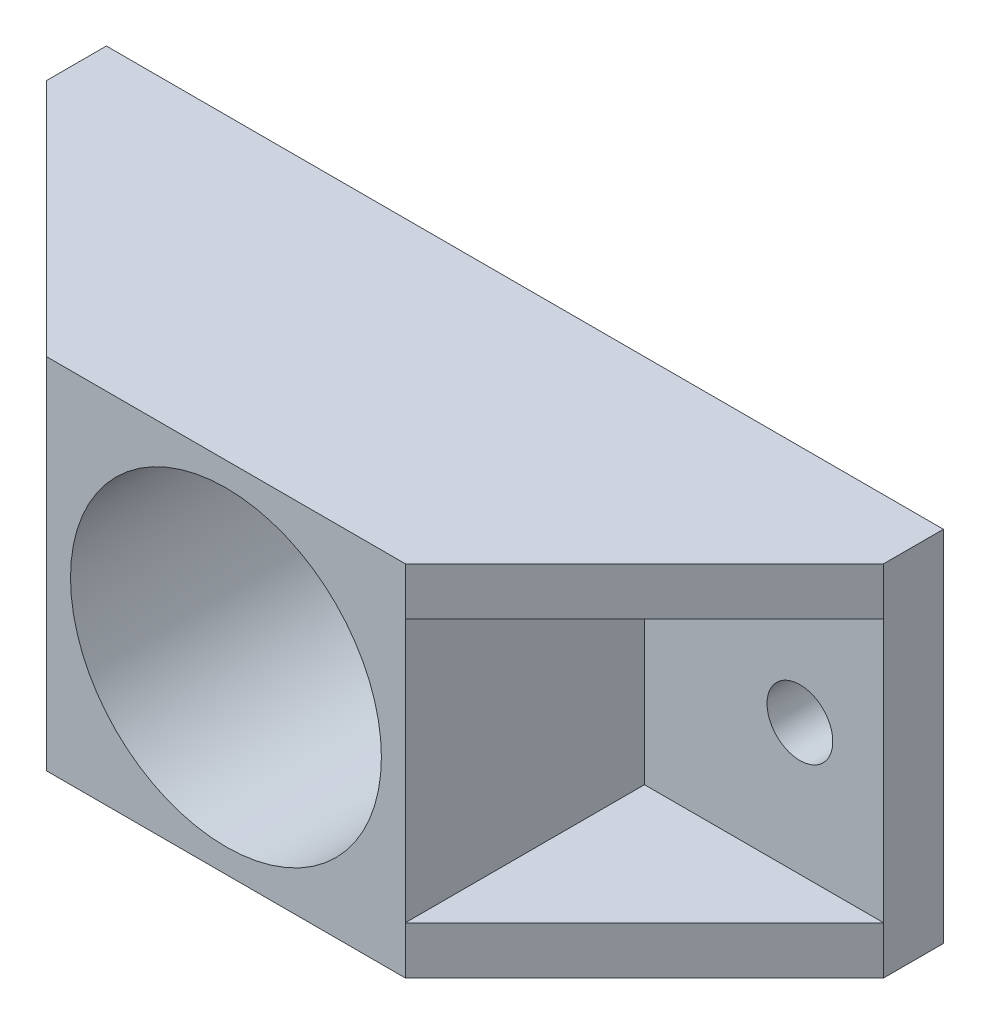
ISO-10303-21;
HEADER;
FILE_DESCRIPTION(('STEP AP214'),'2;1');
FILE_NAME('part.step','',(''),(''),'','','');
FILE_SCHEMA(('AUTOMOTIVE_DESIGN { 1 0 10303 214 1 1 1 1 }'));
ENDSEC;
DATA;
#1=APPLICATION_CONTEXT('core data for automotive mechanical design processes');
#2=APPLICATION_PROTOCOL_DEFINITION('international standard','automotive_design',2000,#1);
#3=PRODUCT_CONTEXT('',#1,'mechanical');
#4=PRODUCT('Part','Part','',(#3));
#5=PRODUCT_RELATED_PRODUCT_CATEGORY('part','',(#4));
#6=PRODUCT_DEFINITION_FORMATION('','',#4);
#7=PRODUCT_DEFINITION_CONTEXT('part definition',#1,'design');
#8=PRODUCT_DEFINITION('design','',#6,#7);
#9=PRODUCT_DEFINITION_SHAPE('','',#8);
#10=(LENGTH_UNIT() NAMED_UNIT(*) SI_UNIT(.MILLI.,.METRE.));
#11=(NAMED_UNIT(*) PLANE_ANGLE_UNIT() SI_UNIT($,.RADIAN.));
#12=(NAMED_UNIT(*) SI_UNIT($,.STERADIAN.) SOLID_ANGLE_UNIT());
#13=UNCERTAINTY_MEASURE_WITH_UNIT(LENGTH_MEASURE(1.E-05),#10,'distance_accuracy_value','');
#14=(GEOMETRIC_REPRESENTATION_CONTEXT(3) GLOBAL_UNCERTAINTY_ASSIGNED_CONTEXT((#13)) GLOBAL_UNIT_ASSIGNED_CONTEXT((#10,
#11,#12)) REPRESENTATION_CONTEXT('',''));
#15=CARTESIAN_POINT('',(0.,0.,0.));
#16=DIRECTION('',(0.,0.,1.));
#17=DIRECTION('',(1.,0.,0.));
#18=AXIS2_PLACEMENT_3D('',#15,#16,#17);
#19=CARTESIAN_POINT('',(0.,0.,5.));
#20=DIRECTION('',(0.,0.,1.));
#21=DIRECTION('',(1.,0.,0.));
#22=AXIS2_PLACEMENT_3D('',#19,#20,#21);
#23=PLANE('',#22);
#24=CARTESIAN_POINT('',(28.,0.,5.));
#25=DIRECTION('',(0.,0.,1.));
#26=DIRECTION('',(-1.,0.,0.));
#27=AXIS2_PLACEMENT_3D('',#24,#25,#26);
#28=CIRCLE('',#27,2.75);
#29=CARTESIAN_POINT('',(25.25,0.,5.));
#30=VERTEX_POINT('',#29);
#31=EDGE_CURVE('E201',#30,#30,#28,.T.);
#32=ORIENTED_EDGE('',*,*,#31,.F.);
#33=EDGE_LOOP('',(#32));
#34=FACE_BOUND('',#33,.T.);
#35=DIRECTION('',(0.,1.,0.));
#36=VECTOR('',#35,1.);
#37=CARTESIAN_POINT('',(35.,15.,5.));
#38=LINE('',#37,#36);
#39=CARTESIAN_POINT('',(35.,-11.,5.));
#40=VERTEX_POINT('',#39);
#41=CARTESIAN_POINT('',(35.,11.,5.));
#42=VERTEX_POINT('',#41);
#43=EDGE_CURVE('E165',#40,#42,#38,.T.);
#44=ORIENTED_EDGE('',*,*,#43,.T.);
#45=DIRECTION('',(1.,0.,0.));
#46=VECTOR('',#45,1.);
#47=CARTESIAN_POINT('',(15.,11.,5.));
#48=LINE('',#47,#46);
#49=CARTESIAN_POINT('',(15.,11.,5.));
#50=VERTEX_POINT('',#49);
#51=EDGE_CURVE('E139',#50,#42,#48,.T.);
#52=ORIENTED_EDGE('',*,*,#51,.F.);
#53=DIRECTION('',(0.,1.,0.));
#54=VECTOR('',#53,1.);
#55=CARTESIAN_POINT('',(15.,-15.,5.));
#56=LINE('',#55,#54);
#57=CARTESIAN_POINT('',(15.,-11.,5.));
#58=VERTEX_POINT('',#57);
#59=EDGE_CURVE('E194',#58,#50,#56,.T.);
#60=ORIENTED_EDGE('',*,*,#59,.F.);
#61=DIRECTION('',(1.,0.,0.));
#62=VECTOR('',#61,1.);
#63=CARTESIAN_POINT('',(15.,-11.,5.));
#64=LINE('',#63,#62);
#65=EDGE_CURVE('E170',#58,#40,#64,.T.);
#66=ORIENTED_EDGE('',*,*,#65,.T.);
#67=EDGE_LOOP('',(#44,#52,#60,#66));
#68=FACE_BOUND('',#67,.T.);
#69=ADVANCED_FACE('F48',(#34,#68),#23,.T.);
#70=CARTESIAN_POINT('',(15.,-15.,25.));
#71=DIRECTION('',(-1.,0.,0.));
#72=DIRECTION('',(0.,0.,1.));
#73=AXIS2_PLACEMENT_3D('',#70,#71,#72);
#74=PLANE('',#73);
#75=DIRECTION('',(0.,0.,-1.));
#76=VECTOR('',#75,1.);
#77=CARTESIAN_POINT('',(15.,11.,25.));
#78=LINE('',#77,#76);
#79=CARTESIAN_POINT('',(15.,11.,25.));
#80=VERTEX_POINT('',#79);
#81=EDGE_CURVE('E145',#80,#50,#78,.T.);
#82=ORIENTED_EDGE('',*,*,#81,.F.);
#83=DIRECTION('',(0.,1.,0.));
#84=VECTOR('',#83,1.);
#85=CARTESIAN_POINT('',(15.,-15.,25.));
#86=LINE('',#85,#84);
#87=CARTESIAN_POINT('',(15.,-11.,25.));
#88=VERTEX_POINT('',#87);
#89=EDGE_CURVE('E287',#88,#80,#86,.T.);
#90=ORIENTED_EDGE('',*,*,#89,.F.);
#91=DIRECTION('',(0.,0.,-1.));
#92=VECTOR('',#91,1.);
#93=CARTESIAN_POINT('',(15.,-11.,25.));
#94=LINE('',#93,#92);
#95=EDGE_CURVE('E322',#88,#58,#94,.T.);
#96=ORIENTED_EDGE('',*,*,#95,.T.);
#97=ORIENTED_EDGE('',*,*,#59,.T.);
#98=EDGE_LOOP('',(#82,#90,#96,#97));
#99=FACE_BOUND('',#98,.T.);
#100=ADVANCED_FACE('F233',(#99),#74,.F.);
#101=DIRECTION('',(1.,0.,0.));
#102=VECTOR('',#101,1.);
#103=CARTESIAN_POINT('',(-35.,11.,5.));
#104=LINE('',#103,#102);
#105=CARTESIAN_POINT('',(-35.,11.,5.));
#106=VERTEX_POINT('',#105);
#107=CARTESIAN_POINT('',(-15.,11.,5.));
#108=VERTEX_POINT('',#107);
#109=EDGE_CURVE('E252',#106,#108,#104,.T.);
#110=ORIENTED_EDGE('',*,*,#109,.F.);
#111=DIRECTION('',(0.,-1.,0.));
#112=VECTOR('',#111,1.);
#113=CARTESIAN_POINT('',(-35.,15.,5.));
#114=LINE('',#113,#112);
#115=CARTESIAN_POINT('',(-35.,-11.,5.));
#116=VERTEX_POINT('',#115);
#117=EDGE_CURVE('E176',#106,#116,#114,.T.);
#118=ORIENTED_EDGE('',*,*,#117,.T.);
#119=DIRECTION('',(1.,0.,0.));
#120=VECTOR('',#119,1.);
#121=CARTESIAN_POINT('',(-35.,-11.,5.));
#122=LINE('',#121,#120);
#123=CARTESIAN_POINT('',(-15.,-11.,5.));
#124=VERTEX_POINT('',#123);
#125=EDGE_CURVE('E273',#116,#124,#122,.T.);
#126=ORIENTED_EDGE('',*,*,#125,.T.);
#127=DIRECTION('',(0.,-1.,0.));
#128=VECTOR('',#127,1.);
#129=CARTESIAN_POINT('',(-15.,-15.,5.));
#130=LINE('',#129,#128);
#131=EDGE_CURVE('E52',#108,#124,#130,.T.);
#132=ORIENTED_EDGE('',*,*,#131,.F.);
#133=EDGE_LOOP('',(#110,#118,#126,#132));
#134=FACE_BOUND('',#133,.T.);
#135=CARTESIAN_POINT('',(-28.,0.,5.));
#136=DIRECTION('',(0.,0.,1.));
#137=DIRECTION('',(1.,0.,0.));
#138=AXIS2_PLACEMENT_3D('',#135,#136,#137);
#139=CIRCLE('',#138,2.75);
#140=CARTESIAN_POINT('',(-25.25,0.,5.));
#141=VERTEX_POINT('',#140);
#142=EDGE_CURVE('E184',#141,#141,#139,.T.);
#143=ORIENTED_EDGE('',*,*,#142,.F.);
#144=EDGE_LOOP('',(#143));
#145=FACE_BOUND('',#144,.T.);
#146=ADVANCED_FACE('F235',(#134,#145),#23,.T.);
#147=CARTESIAN_POINT('',(0.,0.,0.));
#148=DIRECTION('',(0.,0.,1.));
#149=DIRECTION('',(1.,0.,0.));
#150=AXIS2_PLACEMENT_3D('',#147,#148,#149);
#151=PLANE('',#150);
#152=CARTESIAN_POINT('',(0.,0.,0.));
#153=DIRECTION('',(0.,0.,1.));
#154=DIRECTION('',(1.,0.,0.));
#155=AXIS2_PLACEMENT_3D('',#152,#153,#154);
#156=CIRCLE('',#155,13.);
#157=CARTESIAN_POINT('',(13.,0.,0.));
#158=VERTEX_POINT('',#157);
#159=EDGE_CURVE('E270',#158,#158,#156,.T.);
#160=ORIENTED_EDGE('',*,*,#159,.T.);
#161=EDGE_LOOP('',(#160));
#162=FACE_BOUND('',#161,.T.);
#163=DIRECTION('',(0.,-1.,0.));
#164=VECTOR('',#163,1.);
#165=CARTESIAN_POINT('',(-35.,15.,0.));
#166=LINE('',#165,#164);
#167=CARTESIAN_POINT('',(-35.,15.,0.));
#168=VERTEX_POINT('',#167);
#169=CARTESIAN_POINT('',(-35.,-15.,0.));
#170=VERTEX_POINT('',#169);
#171=EDGE_CURVE('E180',#168,#170,#166,.T.);
#172=ORIENTED_EDGE('',*,*,#171,.F.);
#173=DIRECTION('',(-1.,0.,0.));
#174=VECTOR('',#173,1.);
#175=CARTESIAN_POINT('',(-35.,15.,0.));
#176=LINE('',#175,#174);
#177=CARTESIAN_POINT('',(35.,15.,0.));
#178=VERTEX_POINT('',#177);
#179=EDGE_CURVE('E188',#178,#168,#176,.T.);
#180=ORIENTED_EDGE('',*,*,#179,.F.);
#181=DIRECTION('',(0.,1.,0.));
#182=VECTOR('',#181,1.);
#183=CARTESIAN_POINT('',(35.,15.,0.));
#184=LINE('',#183,#182);
#185=CARTESIAN_POINT('',(35.,-15.,0.));
#186=VERTEX_POINT('',#185);
#187=EDGE_CURVE('E186',#186,#178,#184,.T.);
#188=ORIENTED_EDGE('',*,*,#187,.F.);
#189=DIRECTION('',(1.,0.,0.));
#190=VECTOR('',#189,1.);
#191=CARTESIAN_POINT('',(-35.,-15.,0.));
#192=LINE('',#191,#190);
#193=EDGE_CURVE('E183',#170,#186,#192,.T.);
#194=ORIENTED_EDGE('',*,*,#193,.F.);
#195=EDGE_LOOP('',(#172,#180,#188,#194));
#196=FACE_BOUND('',#195,.T.);
#197=CARTESIAN_POINT('',(-28.,0.,0.));
#198=DIRECTION('',(0.,0.,1.));
#199=DIRECTION('',(1.,0.,0.));
#200=AXIS2_PLACEMENT_3D('',#197,#198,#199);
#201=CIRCLE('',#200,2.75);
#202=CARTESIAN_POINT('',(-25.25,0.,0.));
#203=VERTEX_POINT('',#202);
#204=EDGE_CURVE('E204',#203,#203,#201,.T.);
#205=ORIENTED_EDGE('',*,*,#204,.T.);
#206=EDGE_LOOP('',(#205));
#207=FACE_BOUND('',#206,.T.);
#208=CARTESIAN_POINT('',(28.,0.,0.));
#209=DIRECTION('',(0.,0.,1.));
#210=DIRECTION('',(-1.,0.,0.));
#211=AXIS2_PLACEMENT_3D('',#208,#209,#210);
#212=CIRCLE('',#211,2.75);
#213=CARTESIAN_POINT('',(25.25,0.,0.));
#214=VERTEX_POINT('',#213);
#215=EDGE_CURVE('E205',#214,#214,#212,.T.);
#216=ORIENTED_EDGE('',*,*,#215,.T.);
#217=EDGE_LOOP('',(#216));
#218=FACE_BOUND('',#217,.T.);
#219=ADVANCED_FACE('F213',(#162,#196,#207,#218),#151,.F.);
#220=CARTESIAN_POINT('',(-35.,15.,5.));
#221=DIRECTION('',(1.,0.,0.));
#222=DIRECTION('',(0.,1.,0.));
#223=AXIS2_PLACEMENT_3D('',#220,#221,#222);
#224=PLANE('',#223);
#225=ORIENTED_EDGE('',*,*,#171,.T.);
#226=DIRECTION('',(0.,0.,-1.));
#227=VECTOR('',#226,1.);
#228=CARTESIAN_POINT('',(-35.,-15.,5.));
#229=LINE('',#228,#227);
#230=CARTESIAN_POINT('',(-35.,-15.,5.));
#231=VERTEX_POINT('',#230);
#232=EDGE_CURVE('E13',#231,#170,#229,.T.);
#233=ORIENTED_EDGE('',*,*,#232,.F.);
#234=DIRECTION('',(0.,-1.,0.));
#235=VECTOR('',#234,1.);
#236=CARTESIAN_POINT('',(-35.,-11.,5.));
#237=LINE('',#236,#235);
#238=EDGE_CURVE('E263',#116,#231,#237,.T.);
#239=ORIENTED_EDGE('',*,*,#238,.F.);
#240=ORIENTED_EDGE('',*,*,#117,.F.);
#241=CARTESIAN_POINT('',(-35.,15.,5.));
#242=VERTEX_POINT('',#241);
#243=EDGE_CURVE('E172',#242,#106,#114,.T.);
#244=ORIENTED_EDGE('',*,*,#243,.F.);
#245=DIRECTION('',(0.,0.,-1.));
#246=VECTOR('',#245,1.);
#247=CARTESIAN_POINT('',(-35.,15.,5.));
#248=LINE('',#247,#246);
#249=EDGE_CURVE('E174',#242,#168,#248,.T.);
#250=ORIENTED_EDGE('',*,*,#249,.T.);
#251=EDGE_LOOP('',(#225,#233,#239,#240,#244,#250));
#252=FACE_BOUND('',#251,.T.);
#253=ADVANCED_FACE('F50',(#252),#224,.F.);
#254=CARTESIAN_POINT('',(-35.,-15.,5.));
#255=DIRECTION('',(0.,1.,0.));
#256=DIRECTION('',(0.,0.,1.));
#257=AXIS2_PLACEMENT_3D('',#254,#255,#256);
#258=PLANE('',#257);
#259=DIRECTION('',(0.,0.,-1.));
#260=VECTOR('',#259,1.);
#261=CARTESIAN_POINT('',(35.,-15.,5.));
#262=LINE('',#261,#260);
#263=CARTESIAN_POINT('',(35.,-15.,5.));
#264=VERTEX_POINT('',#263);
#265=EDGE_CURVE('E58',#264,#186,#262,.T.);
#266=ORIENTED_EDGE('',*,*,#265,.F.);
#267=DIRECTION('',(-0.707106781186547,0.,0.707106781186548));
#268=VECTOR('',#267,1.);
#269=CARTESIAN_POINT('',(35.,-15.,5.));
#270=LINE('',#269,#268);
#271=CARTESIAN_POINT('',(15.,-15.,25.));
#272=VERTEX_POINT('',#271);
#273=EDGE_CURVE('E302',#264,#272,#270,.T.);
#274=ORIENTED_EDGE('',*,*,#273,.T.);
#275=DIRECTION('',(1.,0.,0.));
#276=VECTOR('',#275,1.);
#277=CARTESIAN_POINT('',(15.,-15.,25.));
#278=LINE('',#277,#276);
#279=CARTESIAN_POINT('',(-15.,-15.,25.));
#280=VERTEX_POINT('',#279);
#281=EDGE_CURVE('E284',#280,#272,#278,.T.);
#282=ORIENTED_EDGE('',*,*,#281,.F.);
#283=DIRECTION('',(-0.707106781186548,0.,-0.707106781186548));
#284=VECTOR('',#283,1.);
#285=CARTESIAN_POINT('',(-15.,-15.,25.));
#286=LINE('',#285,#284);
#287=EDGE_CURVE('E276',#280,#231,#286,.T.);
#288=ORIENTED_EDGE('',*,*,#287,.T.);
#289=ORIENTED_EDGE('',*,*,#232,.T.);
#290=ORIENTED_EDGE('',*,*,#193,.T.);
#291=EDGE_LOOP('',(#266,#274,#282,#288,#289,#290));
#292=FACE_BOUND('',#291,.T.);
#293=ADVANCED_FACE('F414',(#292),#258,.F.);
#294=CARTESIAN_POINT('',(35.,15.,5.));
#295=DIRECTION('',(-1.,0.,0.));
#296=DIRECTION('',(0.,-1.,0.));
#297=AXIS2_PLACEMENT_3D('',#294,#295,#296);
#298=PLANE('',#297);
#299=ORIENTED_EDGE('',*,*,#187,.T.);
#300=DIRECTION('',(0.,0.,-1.));
#301=VECTOR('',#300,1.);
#302=CARTESIAN_POINT('',(35.,15.,5.));
#303=LINE('',#302,#301);
#304=CARTESIAN_POINT('',(35.,15.,5.));
#305=VERTEX_POINT('',#304);
#306=EDGE_CURVE('E167',#305,#178,#303,.T.);
#307=ORIENTED_EDGE('',*,*,#306,.F.);
#308=DIRECTION('',(0.,1.,0.));
#309=VECTOR('',#308,1.);
#310=CARTESIAN_POINT('',(35.,11.,5.));
#311=LINE('',#310,#309);
#312=EDGE_CURVE('E154',#42,#305,#311,.T.);
#313=ORIENTED_EDGE('',*,*,#312,.F.);
#314=ORIENTED_EDGE('',*,*,#43,.F.);
#315=EDGE_CURVE('E171',#264,#40,#38,.T.);
#316=ORIENTED_EDGE('',*,*,#315,.F.);
#317=ORIENTED_EDGE('',*,*,#265,.T.);
#318=EDGE_LOOP('',(#299,#307,#313,#314,#316,#317));
#319=FACE_BOUND('',#318,.T.);
#320=ADVANCED_FACE('F163',(#319),#298,.F.);
#321=CARTESIAN_POINT('',(-35.,15.,5.));
#322=DIRECTION('',(0.,-1.,0.));
#323=DIRECTION('',(1.,0.,0.));
#324=AXIS2_PLACEMENT_3D('',#321,#322,#323);
#325=PLANE('',#324);
#326=ORIENTED_EDGE('',*,*,#249,.F.);
#327=DIRECTION('',(-0.707106781186548,0.,-0.707106781186548));
#328=VECTOR('',#327,1.);
#329=CARTESIAN_POINT('',(-15.,15.,25.));
#330=LINE('',#329,#328);
#331=CARTESIAN_POINT('',(-15.,15.,25.));
#332=VERTEX_POINT('',#331);
#333=EDGE_CURVE('E297',#332,#242,#330,.T.);
#334=ORIENTED_EDGE('',*,*,#333,.F.);
#335=DIRECTION('',(-1.,0.,0.));
#336=VECTOR('',#335,1.);
#337=CARTESIAN_POINT('',(15.,15.,25.));
#338=LINE('',#337,#336);
#339=CARTESIAN_POINT('',(15.,15.,25.));
#340=VERTEX_POINT('',#339);
#341=EDGE_CURVE('E208',#340,#332,#338,.T.);
#342=ORIENTED_EDGE('',*,*,#341,.F.);
#343=DIRECTION('',(-0.707106781186547,0.,0.707106781186548));
#344=VECTOR('',#343,1.);
#345=CARTESIAN_POINT('',(35.,15.,5.));
#346=LINE('',#345,#344);
#347=EDGE_CURVE('E158',#305,#340,#346,.T.);
#348=ORIENTED_EDGE('',*,*,#347,.F.);
#349=ORIENTED_EDGE('',*,*,#306,.T.);
#350=ORIENTED_EDGE('',*,*,#179,.T.);
#351=EDGE_LOOP('',(#326,#334,#342,#348,#349,#350));
#352=FACE_BOUND('',#351,.T.);
#353=ADVANCED_FACE('F219',(#352),#325,.F.);
#354=CARTESIAN_POINT('',(-28.,0.,5.));
#355=DIRECTION('',(0.,0.,-1.));
#356=DIRECTION('',(-1.,0.,0.));
#357=AXIS2_PLACEMENT_3D('',#354,#355,#356);
#358=CYLINDRICAL_SURFACE('',#357,2.75);
#359=ORIENTED_EDGE('',*,*,#142,.T.);
#360=EDGE_LOOP('',(#359));
#361=FACE_BOUND('',#360,.T.);
#362=ORIENTED_EDGE('',*,*,#204,.F.);
#363=EDGE_LOOP('',(#362));
#364=FACE_BOUND('',#363,.T.);
#365=ADVANCED_FACE('F216',(#361,#364),#358,.F.);
#366=CARTESIAN_POINT('',(28.,0.,5.));
#367=DIRECTION('',(0.,0.,-1.));
#368=DIRECTION('',(-1.,0.,0.));
#369=AXIS2_PLACEMENT_3D('',#366,#367,#368);
#370=CYLINDRICAL_SURFACE('',#369,2.75);
#371=ORIENTED_EDGE('',*,*,#31,.T.);
#372=EDGE_LOOP('',(#371));
#373=FACE_BOUND('',#372,.T.);
#374=ORIENTED_EDGE('',*,*,#215,.F.);
#375=EDGE_LOOP('',(#374));
#376=FACE_BOUND('',#375,.T.);
#377=ADVANCED_FACE('F218',(#373,#376),#370,.F.);
#378=CARTESIAN_POINT('',(-15.,-15.,25.));
#379=DIRECTION('',(1.,0.,0.));
#380=DIRECTION('',(0.,0.,-1.));
#381=AXIS2_PLACEMENT_3D('',#378,#379,#380);
#382=PLANE('',#381);
#383=DIRECTION('',(0.,-1.,0.));
#384=VECTOR('',#383,1.);
#385=CARTESIAN_POINT('',(-15.,-15.,25.));
#386=LINE('',#385,#384);
#387=CARTESIAN_POINT('',(-15.,11.,25.));
#388=VERTEX_POINT('',#387);
#389=CARTESIAN_POINT('',(-15.,-11.,25.));
#390=VERTEX_POINT('',#389);
#391=EDGE_CURVE('E196',#388,#390,#386,.T.);
#392=ORIENTED_EDGE('',*,*,#391,.F.);
#393=DIRECTION('',(0.,0.,1.));
#394=VECTOR('',#393,1.);
#395=CARTESIAN_POINT('',(-15.,11.,5.));
#396=LINE('',#395,#394);
#397=EDGE_CURVE('E66',#108,#388,#396,.T.);
#398=ORIENTED_EDGE('',*,*,#397,.F.);
#399=ORIENTED_EDGE('',*,*,#131,.T.);
#400=DIRECTION('',(0.,0.,1.));
#401=VECTOR('',#400,1.);
#402=CARTESIAN_POINT('',(-15.,-11.,5.));
#403=LINE('',#402,#401);
#404=EDGE_CURVE('E307',#124,#390,#403,.T.);
#405=ORIENTED_EDGE('',*,*,#404,.T.);
#406=EDGE_LOOP('',(#392,#398,#399,#405));
#407=FACE_BOUND('',#406,.T.);
#408=ADVANCED_FACE('F226',(#407),#382,.F.);
#409=CARTESIAN_POINT('',(0.,0.,25.));
#410=DIRECTION('',(0.,0.,1.));
#411=DIRECTION('',(1.,0.,0.));
#412=AXIS2_PLACEMENT_3D('',#409,#410,#411);
#413=PLANE('',#412);
#414=CARTESIAN_POINT('',(0.,0.,25.));
#415=DIRECTION('',(0.,0.,1.));
#416=DIRECTION('',(1.,0.,0.));
#417=AXIS2_PLACEMENT_3D('',#414,#415,#416);
#418=CIRCLE('',#417,13.);
#419=CARTESIAN_POINT('',(13.,0.,25.));
#420=VERTEX_POINT('',#419);
#421=EDGE_CURVE('E266',#420,#420,#418,.T.);
#422=ORIENTED_EDGE('',*,*,#421,.F.);
#423=EDGE_LOOP('',(#422));
#424=FACE_BOUND('',#423,.T.);
#425=EDGE_CURVE('E281',#332,#388,#386,.T.);
#426=ORIENTED_EDGE('',*,*,#425,.T.);
#427=ORIENTED_EDGE('',*,*,#391,.T.);
#428=DIRECTION('',(0.,-1.,0.));
#429=VECTOR('',#428,1.);
#430=CARTESIAN_POINT('',(-15.,-11.,25.));
#431=LINE('',#430,#429);
#432=EDGE_CURVE('E267',#390,#280,#431,.T.);
#433=ORIENTED_EDGE('',*,*,#432,.T.);
#434=ORIENTED_EDGE('',*,*,#281,.T.);
#435=EDGE_CURVE('E288',#272,#88,#86,.T.);
#436=ORIENTED_EDGE('',*,*,#435,.T.);
#437=ORIENTED_EDGE('',*,*,#89,.T.);
#438=DIRECTION('',(0.,1.,0.));
#439=VECTOR('',#438,1.);
#440=CARTESIAN_POINT('',(15.,11.,25.));
#441=LINE('',#440,#439);
#442=EDGE_CURVE('E157',#80,#340,#441,.T.);
#443=ORIENTED_EDGE('',*,*,#442,.T.);
#444=ORIENTED_EDGE('',*,*,#341,.T.);
#445=EDGE_LOOP('',(#426,#427,#433,#434,#436,#437,#443,#444));
#446=FACE_BOUND('',#445,.T.);
#447=ADVANCED_FACE('F293',(#424,#446),#413,.T.);
#448=CARTESIAN_POINT('',(0.,0.,0.));
#449=DIRECTION('',(0.,0.,1.));
#450=DIRECTION('',(1.,0.,0.));
#451=AXIS2_PLACEMENT_3D('',#448,#449,#450);
#452=CYLINDRICAL_SURFACE('',#451,13.);
#453=ORIENTED_EDGE('',*,*,#159,.F.);
#454=EDGE_LOOP('',(#453));
#455=FACE_BOUND('',#454,.T.);
#456=ORIENTED_EDGE('',*,*,#421,.T.);
#457=EDGE_LOOP('',(#456));
#458=FACE_BOUND('',#457,.T.);
#459=ADVANCED_FACE('F348',(#455,#458),#452,.F.);
#460=CARTESIAN_POINT('',(-15.,-11.,25.));
#461=DIRECTION('',(-0.707106781186547,0.,0.707106781186547));
#462=DIRECTION('',(0.707106781186548,0.,0.707106781186548));
#463=AXIS2_PLACEMENT_3D('',#460,#461,#462);
#464=PLANE('',#463);
#465=ORIENTED_EDGE('',*,*,#287,.F.);
#466=ORIENTED_EDGE('',*,*,#432,.F.);
#467=DIRECTION('',(-0.707106781186548,0.,-0.707106781186548));
#468=VECTOR('',#467,1.);
#469=CARTESIAN_POINT('',(-15.,-11.,25.));
#470=LINE('',#469,#468);
#471=EDGE_CURVE('E312',#390,#116,#470,.T.);
#472=ORIENTED_EDGE('',*,*,#471,.T.);
#473=ORIENTED_EDGE('',*,*,#238,.T.);
#474=EDGE_LOOP('',(#465,#466,#472,#473));
#475=FACE_BOUND('',#474,.T.);
#476=ADVANCED_FACE('F311',(#475),#464,.T.);
#477=CARTESIAN_POINT('',(0.,-11.,0.));
#478=DIRECTION('',(0.,1.,0.));
#479=DIRECTION('',(0.,0.,1.));
#480=AXIS2_PLACEMENT_3D('',#477,#478,#479);
#481=PLANE('',#480);
#482=ORIENTED_EDGE('',*,*,#404,.F.);
#483=ORIENTED_EDGE('',*,*,#125,.F.);
#484=ORIENTED_EDGE('',*,*,#471,.F.);
#485=EDGE_LOOP('',(#482,#483,#484));
#486=FACE_BOUND('',#485,.T.);
#487=ADVANCED_FACE('F315',(#486),#481,.T.);
#488=CARTESIAN_POINT('',(35.,-11.,5.));
#489=DIRECTION('',(0.707106781186548,0.,0.707106781186547));
#490=DIRECTION('',(0.707106781186547,0.,-0.707106781186548));
#491=AXIS2_PLACEMENT_3D('',#488,#489,#490);
#492=PLANE('',#491);
#493=ORIENTED_EDGE('',*,*,#273,.F.);
#494=ORIENTED_EDGE('',*,*,#315,.T.);
#495=DIRECTION('',(-0.707106781186547,0.,0.707106781186548));
#496=VECTOR('',#495,1.);
#497=CARTESIAN_POINT('',(35.,-11.,5.));
#498=LINE('',#497,#496);
#499=EDGE_CURVE('E74',#40,#88,#498,.T.);
#500=ORIENTED_EDGE('',*,*,#499,.T.);
#501=ORIENTED_EDGE('',*,*,#435,.F.);
#502=EDGE_LOOP('',(#493,#494,#500,#501));
#503=FACE_BOUND('',#502,.T.);
#504=ADVANCED_FACE('F333',(#503),#492,.T.);
#505=CARTESIAN_POINT('',(0.,-11.,0.));
#506=DIRECTION('',(0.,-1.,0.));
#507=DIRECTION('',(0.,0.,-1.));
#508=AXIS2_PLACEMENT_3D('',#505,#506,#507);
#509=PLANE('',#508);
#510=ORIENTED_EDGE('',*,*,#499,.F.);
#511=ORIENTED_EDGE('',*,*,#65,.F.);
#512=ORIENTED_EDGE('',*,*,#95,.F.);
#513=EDGE_LOOP('',(#510,#511,#512));
#514=FACE_BOUND('',#513,.T.);
#515=ADVANCED_FACE('F331',(#514),#509,.F.);
#516=CARTESIAN_POINT('',(-15.,11.,25.));
#517=DIRECTION('',(0.707106781186547,0.,-0.707106781186547));
#518=DIRECTION('',(-0.707106781186548,0.,-0.707106781186548));
#519=AXIS2_PLACEMENT_3D('',#516,#517,#518);
#520=PLANE('',#519);
#521=ORIENTED_EDGE('',*,*,#333,.T.);
#522=ORIENTED_EDGE('',*,*,#243,.T.);
#523=DIRECTION('',(-0.707106781186548,0.,-0.707106781186548));
#524=VECTOR('',#523,1.);
#525=CARTESIAN_POINT('',(-15.,11.,25.));
#526=LINE('',#525,#524);
#527=EDGE_CURVE('E257',#388,#106,#526,.T.);
#528=ORIENTED_EDGE('',*,*,#527,.F.);
#529=ORIENTED_EDGE('',*,*,#425,.F.);
#530=EDGE_LOOP('',(#521,#522,#528,#529));
#531=FACE_BOUND('',#530,.T.);
#532=ADVANCED_FACE('F300',(#531),#520,.F.);
#533=CARTESIAN_POINT('',(0.,11.,0.));
#534=DIRECTION('',(0.,-1.,0.));
#535=DIRECTION('',(0.,0.,1.));
#536=AXIS2_PLACEMENT_3D('',#533,#534,#535);
#537=PLANE('',#536);
#538=ORIENTED_EDGE('',*,*,#397,.T.);
#539=ORIENTED_EDGE('',*,*,#527,.T.);
#540=ORIENTED_EDGE('',*,*,#109,.T.);
#541=EDGE_LOOP('',(#538,#539,#540));
#542=FACE_BOUND('',#541,.T.);
#543=ADVANCED_FACE('F339',(#542),#537,.T.);
#544=CARTESIAN_POINT('',(35.,11.,5.));
#545=DIRECTION('',(-0.707106781186548,0.,-0.707106781186547));
#546=DIRECTION('',(-0.707106781186547,0.,0.707106781186548));
#547=AXIS2_PLACEMENT_3D('',#544,#545,#546);
#548=PLANE('',#547);
#549=ORIENTED_EDGE('',*,*,#347,.T.);
#550=ORIENTED_EDGE('',*,*,#442,.F.);
#551=DIRECTION('',(-0.707106781186547,0.,0.707106781186548));
#552=VECTOR('',#551,1.);
#553=CARTESIAN_POINT('',(35.,11.,5.));
#554=LINE('',#553,#552);
#555=EDGE_CURVE('E142',#42,#80,#554,.T.);
#556=ORIENTED_EDGE('',*,*,#555,.F.);
#557=ORIENTED_EDGE('',*,*,#312,.T.);
#558=EDGE_LOOP('',(#549,#550,#556,#557));
#559=FACE_BOUND('',#558,.T.);
#560=ADVANCED_FACE('F153',(#559),#548,.F.);
#561=CARTESIAN_POINT('',(0.,11.,0.));
#562=DIRECTION('',(0.,1.,0.));
#563=DIRECTION('',(0.,0.,-1.));
#564=AXIS2_PLACEMENT_3D('',#561,#562,#563);
#565=PLANE('',#564);
#566=ORIENTED_EDGE('',*,*,#555,.T.);
#567=ORIENTED_EDGE('',*,*,#81,.T.);
#568=ORIENTED_EDGE('',*,*,#51,.T.);
#569=EDGE_LOOP('',(#566,#567,#568));
#570=FACE_BOUND('',#569,.T.);
#571=ADVANCED_FACE('F141',(#570),#565,.F.);
#572=CLOSED_SHELL('',(#69,#100,#146,#219,#253,#293,#320,#353,#365,#377,#408,#447,#459,#476,#487,
#504,#515,#532,#543,#560,#571));
#573=MANIFOLD_SOLID_BREP('B2',#572);
#574=ADVANCED_BREP_SHAPE_REPRESENTATION('',(#18,#573),#14);
#575=SHAPE_DEFINITION_REPRESENTATION(#9,#574);
ENDSEC;
END-ISO-10303-21;
